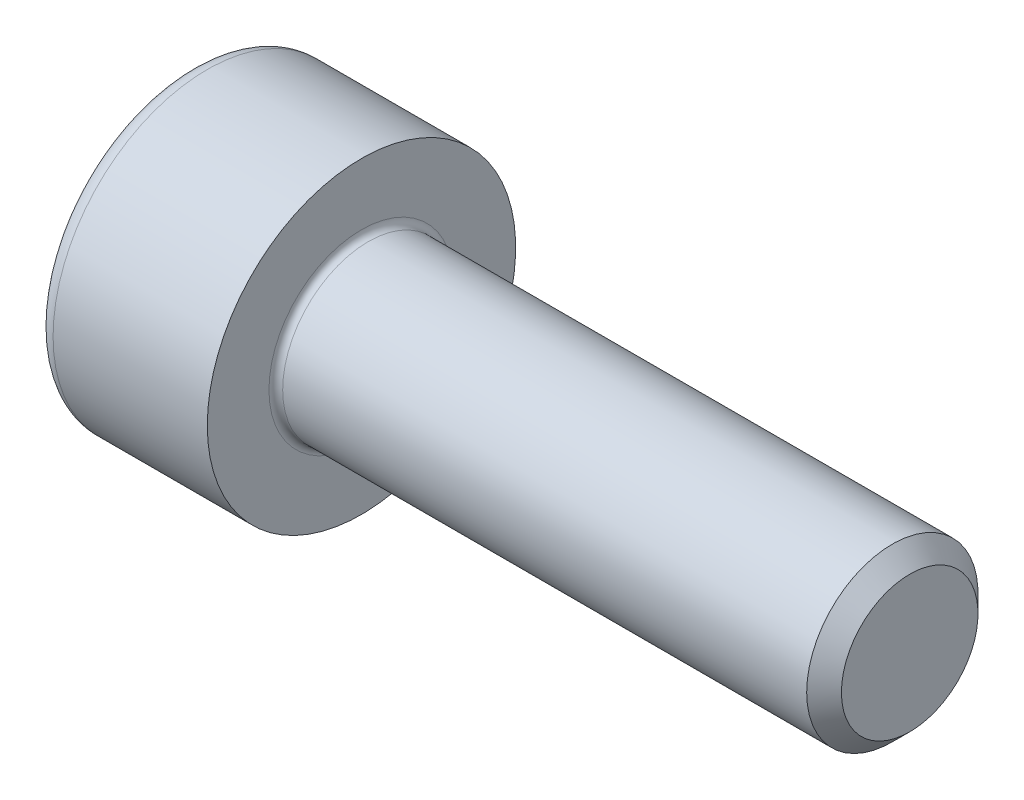
ISO-10303-21;
HEADER;
FILE_DESCRIPTION(('STEP AP214'),'2;1');
FILE_NAME('part.step','',(''),(''),'','','');
FILE_SCHEMA(('AUTOMOTIVE_DESIGN { 1 0 10303 214 1 1 1 1 }'));
ENDSEC;
DATA;
#1=APPLICATION_CONTEXT('core data for automotive mechanical design processes');
#2=APPLICATION_PROTOCOL_DEFINITION('international standard','automotive_design',2000,#1);
#3=PRODUCT_CONTEXT('',#1,'mechanical');
#4=PRODUCT('Part','Part','',(#3));
#5=PRODUCT_RELATED_PRODUCT_CATEGORY('part','',(#4));
#6=PRODUCT_DEFINITION_FORMATION('','',#4);
#7=PRODUCT_DEFINITION_CONTEXT('part definition',#1,'design');
#8=PRODUCT_DEFINITION('design','',#6,#7);
#9=PRODUCT_DEFINITION_SHAPE('','',#8);
#10=(LENGTH_UNIT() NAMED_UNIT(*) SI_UNIT(.MILLI.,.METRE.));
#11=(NAMED_UNIT(*) PLANE_ANGLE_UNIT() SI_UNIT($,.RADIAN.));
#12=(NAMED_UNIT(*) SI_UNIT($,.STERADIAN.) SOLID_ANGLE_UNIT());
#13=UNCERTAINTY_MEASURE_WITH_UNIT(LENGTH_MEASURE(1.E-05),#10,'distance_accuracy_value','');
#14=(GEOMETRIC_REPRESENTATION_CONTEXT(3) GLOBAL_UNCERTAINTY_ASSIGNED_CONTEXT((#13)) GLOBAL_UNIT_ASSIGNED_CONTEXT((#10,
#11,#12)) REPRESENTATION_CONTEXT('',''));
#15=CARTESIAN_POINT('',(0.,0.,0.));
#16=DIRECTION('',(0.,0.,1.));
#17=DIRECTION('',(1.,0.,0.));
#18=AXIS2_PLACEMENT_3D('',#15,#16,#17);
#19=CARTESIAN_POINT('',(0.,0.,0.));
#20=DIRECTION('',(-1.,0.,0.));
#21=DIRECTION('',(0.,0.,1.));
#22=AXIS2_PLACEMENT_3D('',#19,#20,#21);
#23=PLANE('',#22);
#24=DIRECTION('',(0.,-0.499999999999999,0.866025403784439));
#25=VECTOR('',#24,1.);
#26=CARTESIAN_POINT('',(0.,1.16624754376304,0.));
#27=LINE('',#26,#25);
#28=CARTESIAN_POINT('',(0.,1.16624754376304,0.));
#29=VERTEX_POINT('',#28);
#30=CARTESIAN_POINT('',(0.,0.583123771881517,1.01));
#31=VERTEX_POINT('',#30);
#32=EDGE_CURVE('E262',#29,#31,#27,.T.);
#33=ORIENTED_EDGE('',*,*,#32,.T.);
#34=DIRECTION('',(0.,1.,0.));
#35=VECTOR('',#34,1.);
#36=CARTESIAN_POINT('',(0.,-0.583123771881527,1.01));
#37=LINE('',#36,#35);
#38=CARTESIAN_POINT('',(0.,-0.583123771881527,1.01));
#39=VERTEX_POINT('',#38);
#40=EDGE_CURVE('E134',#39,#31,#37,.T.);
#41=ORIENTED_EDGE('',*,*,#40,.F.);
#42=DIRECTION('',(0.,-0.500000000000001,-0.866025403784438));
#43=VECTOR('',#42,1.);
#44=CARTESIAN_POINT('',(0.,-0.583123771881527,1.01));
#45=LINE('',#44,#43);
#46=CARTESIAN_POINT('',(0.,-1.16624754376305,0.));
#47=VERTEX_POINT('',#46);
#48=EDGE_CURVE('E265',#39,#47,#45,.T.);
#49=ORIENTED_EDGE('',*,*,#48,.T.);
#50=DIRECTION('',(0.,0.499999999999999,-0.866025403784439));
#51=VECTOR('',#50,1.);
#52=CARTESIAN_POINT('',(0.,-1.16624754376305,0.));
#53=LINE('',#52,#51);
#54=CARTESIAN_POINT('',(0.,-0.58312377188153,-1.01));
#55=VERTEX_POINT('',#54);
#56=EDGE_CURVE('E268',#47,#55,#53,.T.);
#57=ORIENTED_EDGE('',*,*,#56,.T.);
#58=DIRECTION('',(0.,-1.,0.));
#59=VECTOR('',#58,1.);
#60=CARTESIAN_POINT('',(0.,0.583123771881514,-1.01));
#61=LINE('',#60,#59);
#62=CARTESIAN_POINT('',(0.,0.583123771881514,-1.01));
#63=VERTEX_POINT('',#62);
#64=EDGE_CURVE('E271',#63,#55,#61,.T.);
#65=ORIENTED_EDGE('',*,*,#64,.F.);
#66=DIRECTION('',(0.,-0.500000000000001,-0.866025403784438));
#67=VECTOR('',#66,1.);
#68=CARTESIAN_POINT('',(0.,1.16624754376304,0.));
#69=LINE('',#68,#67);
#70=EDGE_CURVE('E129',#29,#63,#69,.T.);
#71=ORIENTED_EDGE('',*,*,#70,.F.);
#72=EDGE_LOOP('',(#33,#41,#49,#57,#65,#71));
#73=FACE_BOUND('',#72,.T.);
#74=CARTESIAN_POINT('',(0.,0.,0.));
#75=DIRECTION('',(-1.,0.,0.));
#76=DIRECTION('',(0.,0.,1.));
#77=AXIS2_PLACEMENT_3D('',#74,#75,#76);
#78=CIRCLE('',#77,2.);
#79=CARTESIAN_POINT('',(0.,0.,2.));
#80=VERTEX_POINT('',#79);
#81=EDGE_CURVE('E46',#80,#80,#78,.T.);
#82=ORIENTED_EDGE('',*,*,#81,.T.);
#83=EDGE_LOOP('',(#82));
#84=FACE_BOUND('',#83,.T.);
#85=ADVANCED_FACE('F38',(#73,#84),#23,.T.);
#86=CARTESIAN_POINT('',(-31.75,0.,0.));
#87=DIRECTION('',(-1.,0.,0.));
#88=DIRECTION('',(0.,0.,1.));
#89=AXIS2_PLACEMENT_3D('',#86,#87,#88);
#90=CYLINDRICAL_SURFACE('',#89,2.25);
#91=CARTESIAN_POINT('',(0.25,0.,0.));
#92=DIRECTION('',(-1.,0.,0.));
#93=DIRECTION('',(0.,0.,1.));
#94=AXIS2_PLACEMENT_3D('',#91,#92,#93);
#95=CIRCLE('',#94,2.25);
#96=CARTESIAN_POINT('',(0.25,0.,2.25));
#97=VERTEX_POINT('',#96);
#98=EDGE_CURVE('E11',#97,#97,#95,.F.);
#99=ORIENTED_EDGE('',*,*,#98,.T.);
#100=EDGE_LOOP('',(#99));
#101=FACE_BOUND('',#100,.T.);
#102=CARTESIAN_POINT('',(2.5,0.,0.));
#103=DIRECTION('',(-1.,0.,0.));
#104=DIRECTION('',(0.,0.,1.));
#105=AXIS2_PLACEMENT_3D('',#102,#103,#104);
#106=CIRCLE('',#105,2.25);
#107=CARTESIAN_POINT('',(2.5,0.,2.25));
#108=VERTEX_POINT('',#107);
#109=EDGE_CURVE('E152',#108,#108,#106,.T.);
#110=ORIENTED_EDGE('',*,*,#109,.T.);
#111=EDGE_LOOP('',(#110));
#112=FACE_BOUND('',#111,.T.);
#113=ADVANCED_FACE('F176',(#101,#112),#90,.T.);
#114=CARTESIAN_POINT('',(2.5,2.25,0.));
#115=DIRECTION('',(1.,0.,0.));
#116=DIRECTION('',(0.,0.,-1.));
#117=AXIS2_PLACEMENT_3D('',#114,#115,#116);
#118=PLANE('',#117);
#119=CARTESIAN_POINT('',(2.5,0.,0.));
#120=DIRECTION('',(1.,0.,0.));
#121=DIRECTION('',(0.,0.,-1.));
#122=AXIS2_PLACEMENT_3D('',#119,#120,#121);
#123=CIRCLE('',#122,1.35);
#124=CARTESIAN_POINT('',(2.5,0.,-1.35));
#125=VERTEX_POINT('',#124);
#126=EDGE_CURVE('E155',#125,#125,#123,.F.);
#127=ORIENTED_EDGE('',*,*,#126,.T.);
#128=EDGE_LOOP('',(#127));
#129=FACE_BOUND('',#128,.T.);
#130=ORIENTED_EDGE('',*,*,#109,.F.);
#131=EDGE_LOOP('',(#130));
#132=FACE_BOUND('',#131,.T.);
#133=ADVANCED_FACE('F182',(#129,#132),#118,.T.);
#134=CARTESIAN_POINT('',(-31.75,0.,0.));
#135=DIRECTION('',(-1.,0.,0.));
#136=DIRECTION('',(0.,0.,1.));
#137=AXIS2_PLACEMENT_3D('',#134,#135,#136);
#138=CYLINDRICAL_SURFACE('',#137,1.25);
#139=CARTESIAN_POINT('',(2.6,0.,0.));
#140=DIRECTION('',(1.,0.,0.));
#141=DIRECTION('',(0.,0.,-1.));
#142=AXIS2_PLACEMENT_3D('',#139,#140,#141);
#143=CIRCLE('',#142,1.25);
#144=CARTESIAN_POINT('',(2.6,0.,-1.25));
#145=VERTEX_POINT('',#144);
#146=EDGE_CURVE('E158',#145,#145,#143,.T.);
#147=ORIENTED_EDGE('',*,*,#146,.T.);
#148=EDGE_LOOP('',(#147));
#149=FACE_BOUND('',#148,.T.);
#150=CARTESIAN_POINT('',(10.2465,0.,0.));
#151=DIRECTION('',(-1.,0.,0.));
#152=DIRECTION('',(0.,0.,1.));
#153=AXIS2_PLACEMENT_3D('',#150,#151,#152);
#154=CIRCLE('',#153,1.24999999999999);
#155=CARTESIAN_POINT('',(10.2465,0.,1.24999999999999));
#156=VERTEX_POINT('',#155);
#157=EDGE_CURVE('E149',#156,#156,#154,.T.);
#158=ORIENTED_EDGE('',*,*,#157,.T.);
#159=EDGE_LOOP('',(#158));
#160=FACE_BOUND('',#159,.T.);
#161=ADVANCED_FACE('F188',(#149,#160),#138,.T.);
#162=CARTESIAN_POINT('',(10.5,0.,0.));
#163=DIRECTION('',(-1.,0.,0.));
#164=DIRECTION('',(0.,0.,1.));
#165=AXIS2_PLACEMENT_3D('',#162,#163,#164);
#166=CONICAL_SURFACE('',#165,0.9965,0.78539816339743);
#167=ORIENTED_EDGE('',*,*,#157,.F.);
#168=EDGE_LOOP('',(#167));
#169=FACE_BOUND('',#168,.T.);
#170=CARTESIAN_POINT('',(10.5,0.,0.));
#171=DIRECTION('',(-1.,0.,0.));
#172=DIRECTION('',(0.,0.,1.));
#173=AXIS2_PLACEMENT_3D('',#170,#171,#172);
#174=CIRCLE('',#173,0.9965);
#175=CARTESIAN_POINT('',(10.5,0.,0.9965));
#176=VERTEX_POINT('',#175);
#177=EDGE_CURVE('E145',#176,#176,#174,.T.);
#178=ORIENTED_EDGE('',*,*,#177,.T.);
#179=EDGE_LOOP('',(#178));
#180=FACE_BOUND('',#179,.T.);
#181=ADVANCED_FACE('F192',(#169,#180),#166,.T.);
#182=CARTESIAN_POINT('',(10.5,0.9965,0.));
#183=DIRECTION('',(1.,0.,0.));
#184=DIRECTION('',(0.,0.,-1.));
#185=AXIS2_PLACEMENT_3D('',#182,#183,#184);
#186=PLANE('',#185);
#187=ORIENTED_EDGE('',*,*,#177,.F.);
#188=EDGE_LOOP('',(#187));
#189=FACE_BOUND('',#188,.T.);
#190=ADVANCED_FACE('F172',(#189),#186,.T.);
#191=CARTESIAN_POINT('',(2.6,0.,0.));
#192=DIRECTION('',(1.,0.,0.));
#193=DIRECTION('',(0.,0.,-1.));
#194=AXIS2_PLACEMENT_3D('',#191,#192,#193);
#195=TOROIDAL_SURFACE('',#194,1.35,0.1);
#196=ORIENTED_EDGE('',*,*,#146,.F.);
#197=EDGE_LOOP('',(#196));
#198=FACE_BOUND('',#197,.T.);
#199=ORIENTED_EDGE('',*,*,#126,.F.);
#200=EDGE_LOOP('',(#199));
#201=FACE_BOUND('',#200,.T.);
#202=ADVANCED_FACE('F165',(#198,#201),#195,.F.);
#203=CARTESIAN_POINT('',(0.25,0.,0.));
#204=DIRECTION('',(-1.,0.,0.));
#205=DIRECTION('',(0.,0.,1.));
#206=AXIS2_PLACEMENT_3D('',#203,#204,#205);
#207=TOROIDAL_SURFACE('',#206,2.,0.25);
#208=ORIENTED_EDGE('',*,*,#98,.F.);
#209=EDGE_LOOP('',(#208));
#210=FACE_BOUND('',#209,.T.);
#211=ORIENTED_EDGE('',*,*,#81,.F.);
#212=EDGE_LOOP('',(#211));
#213=FACE_BOUND('',#212,.T.);
#214=ADVANCED_FACE('F40',(#210,#213),#207,.T.);
#215=CARTESIAN_POINT('',(1.1,1.16624754376304,0.));
#216=DIRECTION('',(0.,-0.866025403784439,-0.499999999999999));
#217=DIRECTION('',(0.,0.499999999999999,-0.86602540378444));
#218=AXIS2_PLACEMENT_3D('',#215,#216,#217);
#219=PLANE('',#218);
#220=ORIENTED_EDGE('',*,*,#32,.F.);
#221=DIRECTION('',(-1.,0.,0.));
#222=VECTOR('',#221,1.);
#223=CARTESIAN_POINT('',(1.1,1.16624754376304,0.));
#224=LINE('',#223,#222);
#225=CARTESIAN_POINT('',(1.1,1.16624754376304,0.));
#226=VERTEX_POINT('',#225);
#227=EDGE_CURVE('E252',#226,#29,#224,.T.);
#228=ORIENTED_EDGE('',*,*,#227,.F.);
#229=DIRECTION('',(0.,-0.499999999999999,0.866025403784439));
#230=VECTOR('',#229,1.);
#231=CARTESIAN_POINT('',(1.1,1.16624754376304,0.));
#232=LINE('',#231,#230);
#233=CARTESIAN_POINT('',(1.1,0.874685657822278,0.504999999999995));
#234=VERTEX_POINT('',#233);
#235=EDGE_CURVE('E121',#226,#234,#232,.T.);
#236=ORIENTED_EDGE('',*,*,#235,.T.);
#237=CARTESIAN_POINT('',(1.1,0.583123771881517,1.01));
#238=VERTEX_POINT('',#237);
#239=EDGE_CURVE('E112',#234,#238,#232,.T.);
#240=ORIENTED_EDGE('',*,*,#239,.T.);
#241=DIRECTION('',(-1.,0.,0.));
#242=VECTOR('',#241,1.);
#243=CARTESIAN_POINT('',(1.1,0.583123771881517,1.01));
#244=LINE('',#243,#242);
#245=EDGE_CURVE('E126',#238,#31,#244,.T.);
#246=ORIENTED_EDGE('',*,*,#245,.T.);
#247=EDGE_LOOP('',(#220,#228,#236,#240,#246));
#248=FACE_BOUND('',#247,.T.);
#249=ADVANCED_FACE('F125',(#248),#219,.T.);
#250=CARTESIAN_POINT('',(1.1,-0.583123771881527,1.01));
#251=DIRECTION('',(0.,0.,1.));
#252=DIRECTION('',(0.,-1.,0.));
#253=AXIS2_PLACEMENT_3D('',#250,#251,#252);
#254=PLANE('',#253);
#255=ORIENTED_EDGE('',*,*,#40,.T.);
#256=ORIENTED_EDGE('',*,*,#245,.F.);
#257=DIRECTION('',(0.,1.,0.));
#258=VECTOR('',#257,1.);
#259=CARTESIAN_POINT('',(1.1,-0.583123771881527,1.01));
#260=LINE('',#259,#258);
#261=CARTESIAN_POINT('',(1.1,0.,1.01));
#262=VERTEX_POINT('',#261);
#263=EDGE_CURVE('E109',#262,#238,#260,.T.);
#264=ORIENTED_EDGE('',*,*,#263,.F.);
#265=CARTESIAN_POINT('',(1.1,-0.583123771881527,1.01));
#266=VERTEX_POINT('',#265);
#267=EDGE_CURVE('E120',#266,#262,#260,.T.);
#268=ORIENTED_EDGE('',*,*,#267,.F.);
#269=DIRECTION('',(-1.,0.,0.));
#270=VECTOR('',#269,1.);
#271=CARTESIAN_POINT('',(1.1,-0.583123771881527,1.01));
#272=LINE('',#271,#270);
#273=EDGE_CURVE('E136',#266,#39,#272,.T.);
#274=ORIENTED_EDGE('',*,*,#273,.T.);
#275=EDGE_LOOP('',(#255,#256,#264,#268,#274));
#276=FACE_BOUND('',#275,.T.);
#277=ADVANCED_FACE('F131',(#276),#254,.F.);
#278=CARTESIAN_POINT('',(1.1,-0.583123771881527,1.01));
#279=DIRECTION('',(0.,0.866025403784438,-0.500000000000001));
#280=DIRECTION('',(0.,0.500000000000001,0.866025403784438));
#281=AXIS2_PLACEMENT_3D('',#278,#279,#280);
#282=PLANE('',#281);
#283=ORIENTED_EDGE('',*,*,#48,.F.);
#284=ORIENTED_EDGE('',*,*,#273,.F.);
#285=DIRECTION('',(0.,-0.500000000000001,-0.866025403784438));
#286=VECTOR('',#285,1.);
#287=CARTESIAN_POINT('',(1.1,-0.583123771881527,1.01));
#288=LINE('',#287,#286);
#289=CARTESIAN_POINT('',(1.1,-0.874685657822286,0.505000000000003));
#290=VERTEX_POINT('',#289);
#291=EDGE_CURVE('E291',#266,#290,#288,.T.);
#292=ORIENTED_EDGE('',*,*,#291,.T.);
#293=CARTESIAN_POINT('',(1.1,-1.16624754376305,0.));
#294=VERTEX_POINT('',#293);
#295=EDGE_CURVE('E280',#290,#294,#288,.T.);
#296=ORIENTED_EDGE('',*,*,#295,.T.);
#297=DIRECTION('',(-1.,0.,0.));
#298=VECTOR('',#297,1.);
#299=CARTESIAN_POINT('',(1.1,-1.16624754376305,0.));
#300=LINE('',#299,#298);
#301=EDGE_CURVE('E141',#294,#47,#300,.T.);
#302=ORIENTED_EDGE('',*,*,#301,.T.);
#303=EDGE_LOOP('',(#283,#284,#292,#296,#302));
#304=FACE_BOUND('',#303,.T.);
#305=ADVANCED_FACE('F206',(#304),#282,.T.);
#306=CARTESIAN_POINT('',(1.1,-1.16624754376305,0.));
#307=DIRECTION('',(0.,0.866025403784439,0.499999999999999));
#308=DIRECTION('',(0.,-0.499999999999999,0.86602540378444));
#309=AXIS2_PLACEMENT_3D('',#306,#307,#308);
#310=PLANE('',#309);
#311=ORIENTED_EDGE('',*,*,#56,.F.);
#312=ORIENTED_EDGE('',*,*,#301,.F.);
#313=DIRECTION('',(0.,0.499999999999999,-0.866025403784439));
#314=VECTOR('',#313,1.);
#315=CARTESIAN_POINT('',(1.1,-1.16624754376305,0.));
#316=LINE('',#315,#314);
#317=CARTESIAN_POINT('',(1.1,-0.874685657822289,-0.505000000000002));
#318=VERTEX_POINT('',#317);
#319=EDGE_CURVE('E258',#294,#318,#316,.T.);
#320=ORIENTED_EDGE('',*,*,#319,.T.);
#321=CARTESIAN_POINT('',(1.1,-0.58312377188153,-1.01));
#322=VERTEX_POINT('',#321);
#323=EDGE_CURVE('E290',#318,#322,#316,.T.);
#324=ORIENTED_EDGE('',*,*,#323,.T.);
#325=DIRECTION('',(-1.,0.,0.));
#326=VECTOR('',#325,1.);
#327=CARTESIAN_POINT('',(1.1,-0.58312377188153,-1.01));
#328=LINE('',#327,#326);
#329=EDGE_CURVE('E251',#322,#55,#328,.T.);
#330=ORIENTED_EDGE('',*,*,#329,.T.);
#331=EDGE_LOOP('',(#311,#312,#320,#324,#330));
#332=FACE_BOUND('',#331,.T.);
#333=ADVANCED_FACE('F209',(#332),#310,.T.);
#334=CARTESIAN_POINT('',(1.1,0.583123771881514,-1.01));
#335=DIRECTION('',(0.,0.,-1.));
#336=DIRECTION('',(0.,1.,0.));
#337=AXIS2_PLACEMENT_3D('',#334,#335,#336);
#338=PLANE('',#337);
#339=ORIENTED_EDGE('',*,*,#64,.T.);
#340=ORIENTED_EDGE('',*,*,#329,.F.);
#341=DIRECTION('',(0.,-1.,0.));
#342=VECTOR('',#341,1.);
#343=CARTESIAN_POINT('',(1.1,0.583123771881514,-1.01));
#344=LINE('',#343,#342);
#345=CARTESIAN_POINT('',(1.1,0.,-1.01));
#346=VERTEX_POINT('',#345);
#347=EDGE_CURVE('E255',#346,#322,#344,.T.);
#348=ORIENTED_EDGE('',*,*,#347,.F.);
#349=CARTESIAN_POINT('',(1.1,0.583123771881514,-1.01));
#350=VERTEX_POINT('',#349);
#351=EDGE_CURVE('E53',#350,#346,#344,.T.);
#352=ORIENTED_EDGE('',*,*,#351,.F.);
#353=DIRECTION('',(-1.,0.,0.));
#354=VECTOR('',#353,1.);
#355=CARTESIAN_POINT('',(1.1,0.583123771881514,-1.01));
#356=LINE('',#355,#354);
#357=EDGE_CURVE('E248',#350,#63,#356,.T.);
#358=ORIENTED_EDGE('',*,*,#357,.T.);
#359=EDGE_LOOP('',(#339,#340,#348,#352,#358));
#360=FACE_BOUND('',#359,.T.);
#361=ADVANCED_FACE('F213',(#360),#338,.F.);
#362=CARTESIAN_POINT('',(1.1,1.16624754376304,0.));
#363=DIRECTION('',(0.,0.866025403784438,-0.500000000000001));
#364=DIRECTION('',(0.,0.500000000000001,0.866025403784438));
#365=AXIS2_PLACEMENT_3D('',#362,#363,#364);
#366=PLANE('',#365);
#367=ORIENTED_EDGE('',*,*,#70,.T.);
#368=ORIENTED_EDGE('',*,*,#357,.F.);
#369=DIRECTION('',(0.,-0.500000000000001,-0.866025403784438));
#370=VECTOR('',#369,1.);
#371=CARTESIAN_POINT('',(1.1,1.16624754376304,0.));
#372=LINE('',#371,#370);
#373=CARTESIAN_POINT('',(1.1,0.874685657822278,-0.504999999999999));
#374=VERTEX_POINT('',#373);
#375=EDGE_CURVE('E238',#374,#350,#372,.T.);
#376=ORIENTED_EDGE('',*,*,#375,.F.);
#377=EDGE_CURVE('E244',#226,#374,#372,.T.);
#378=ORIENTED_EDGE('',*,*,#377,.F.);
#379=ORIENTED_EDGE('',*,*,#227,.T.);
#380=EDGE_LOOP('',(#367,#368,#376,#378,#379));
#381=FACE_BOUND('',#380,.T.);
#382=ADVANCED_FACE('F217',(#381),#366,.F.);
#383=CARTESIAN_POINT('',(1.1,1.74937131564456,-1.01));
#384=DIRECTION('',(1.,0.,0.));
#385=DIRECTION('',(0.,0.,-1.));
#386=AXIS2_PLACEMENT_3D('',#383,#384,#385);
#387=PLANE('',#386);
#388=ORIENTED_EDGE('',*,*,#347,.T.);
#389=ORIENTED_EDGE('',*,*,#323,.F.);
#390=CARTESIAN_POINT('',(1.1,0.,0.));
#391=DIRECTION('',(-1.,0.,0.));
#392=DIRECTION('',(0.,0.,1.));
#393=AXIS2_PLACEMENT_3D('',#390,#391,#392);
#394=CIRCLE('',#393,1.01);
#395=EDGE_CURVE('E286',#346,#318,#394,.T.);
#396=ORIENTED_EDGE('',*,*,#395,.F.);
#397=EDGE_LOOP('',(#388,#389,#396));
#398=FACE_BOUND('',#397,.T.);
#399=ADVANCED_FACE('F221',(#398),#387,.F.);
#400=ORIENTED_EDGE('',*,*,#319,.F.);
#401=ORIENTED_EDGE('',*,*,#295,.F.);
#402=EDGE_CURVE('E139',#318,#290,#394,.T.);
#403=ORIENTED_EDGE('',*,*,#402,.F.);
#404=EDGE_LOOP('',(#400,#401,#403));
#405=FACE_BOUND('',#404,.T.);
#406=ADVANCED_FACE('F224',(#405),#387,.F.);
#407=ORIENTED_EDGE('',*,*,#291,.F.);
#408=ORIENTED_EDGE('',*,*,#267,.T.);
#409=EDGE_CURVE('E135',#290,#262,#394,.T.);
#410=ORIENTED_EDGE('',*,*,#409,.F.);
#411=EDGE_LOOP('',(#407,#408,#410));
#412=FACE_BOUND('',#411,.T.);
#413=ADVANCED_FACE('F229',(#412),#387,.F.);
#414=ORIENTED_EDGE('',*,*,#263,.T.);
#415=ORIENTED_EDGE('',*,*,#239,.F.);
#416=EDGE_CURVE('E115',#262,#234,#394,.T.);
#417=ORIENTED_EDGE('',*,*,#416,.F.);
#418=EDGE_LOOP('',(#414,#415,#417));
#419=FACE_BOUND('',#418,.T.);
#420=ADVANCED_FACE('F111',(#419),#387,.F.);
#421=ORIENTED_EDGE('',*,*,#235,.F.);
#422=ORIENTED_EDGE('',*,*,#377,.T.);
#423=EDGE_CURVE('E146',#234,#374,#394,.T.);
#424=ORIENTED_EDGE('',*,*,#423,.F.);
#425=EDGE_LOOP('',(#421,#422,#424));
#426=FACE_BOUND('',#425,.T.);
#427=ADVANCED_FACE('F232',(#426),#387,.F.);
#428=ORIENTED_EDGE('',*,*,#375,.T.);
#429=ORIENTED_EDGE('',*,*,#351,.T.);
#430=EDGE_CURVE('E241',#374,#346,#394,.T.);
#431=ORIENTED_EDGE('',*,*,#430,.F.);
#432=EDGE_LOOP('',(#428,#429,#431));
#433=FACE_BOUND('',#432,.T.);
#434=ADVANCED_FACE('F202',(#433),#387,.F.);
#435=CARTESIAN_POINT('',(1.1,0.,0.));
#436=DIRECTION('',(-1.,0.,0.));
#437=DIRECTION('',(0.,0.,1.));
#438=AXIS2_PLACEMENT_3D('',#435,#436,#437);
#439=CONICAL_SURFACE('',#438,1.01,1.0471975511966);
#440=CARTESIAN_POINT('',(1.68312377188153,0.,0.));
#441=VERTEX_POINT('',#440);
#442=VERTEX_LOOP('',#441);
#443=FACE_BOUND('',#442,.T.);
#444=ORIENTED_EDGE('',*,*,#416,.T.);
#445=ORIENTED_EDGE('',*,*,#423,.T.);
#446=ORIENTED_EDGE('',*,*,#430,.T.);
#447=ORIENTED_EDGE('',*,*,#395,.T.);
#448=ORIENTED_EDGE('',*,*,#402,.T.);
#449=ORIENTED_EDGE('',*,*,#409,.T.);
#450=EDGE_LOOP('',(#444,#445,#446,#447,#448,#449));
#451=FACE_BOUND('',#450,.T.);
#452=ADVANCED_FACE('F200',(#443,#451),#439,.F.);
#453=CLOSED_SHELL('',(#85,#113,#133,#161,#181,#190,#202,#214,#249,#277,#305,#333,#361,#382,#399,
#406,#413,#420,#427,#434,#452));
#454=MANIFOLD_SOLID_BREP('B2',#453);
#455=ADVANCED_BREP_SHAPE_REPRESENTATION('',(#18,#454),#14);
#456=SHAPE_DEFINITION_REPRESENTATION(#9,#455);
ENDSEC;
END-ISO-10303-21;
